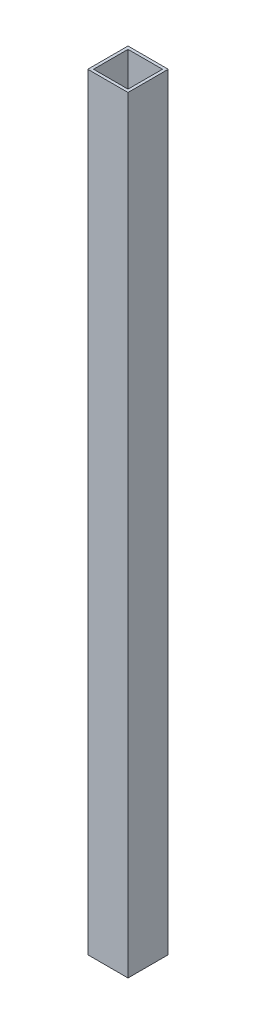
ISO-10303-21;
HEADER;
FILE_DESCRIPTION(('STEP AP214'),'2;1');
FILE_NAME('part.step','',(''),(''),'','','');
FILE_SCHEMA(('AUTOMOTIVE_DESIGN { 1 0 10303 214 1 1 1 1 }'));
ENDSEC;
DATA;
#1=APPLICATION_CONTEXT('core data for automotive mechanical design processes');
#2=APPLICATION_PROTOCOL_DEFINITION('international standard','automotive_design',2000,#1);
#3=PRODUCT_CONTEXT('',#1,'mechanical');
#4=PRODUCT('Part','Part','',(#3));
#5=PRODUCT_RELATED_PRODUCT_CATEGORY('part','',(#4));
#6=PRODUCT_DEFINITION_FORMATION('','',#4);
#7=PRODUCT_DEFINITION_CONTEXT('part definition',#1,'design');
#8=PRODUCT_DEFINITION('design','',#6,#7);
#9=PRODUCT_DEFINITION_SHAPE('','',#8);
#10=(LENGTH_UNIT() NAMED_UNIT(*) SI_UNIT(.MILLI.,.METRE.));
#11=(NAMED_UNIT(*) PLANE_ANGLE_UNIT() SI_UNIT($,.RADIAN.));
#12=(NAMED_UNIT(*) SI_UNIT($,.STERADIAN.) SOLID_ANGLE_UNIT());
#13=UNCERTAINTY_MEASURE_WITH_UNIT(LENGTH_MEASURE(1.E-05),#10,'distance_accuracy_value','');
#14=(GEOMETRIC_REPRESENTATION_CONTEXT(3) GLOBAL_UNCERTAINTY_ASSIGNED_CONTEXT((#13)) GLOBAL_UNIT_ASSIGNED_CONTEXT((#10,
#11,#12)) REPRESENTATION_CONTEXT('',''));
#15=CARTESIAN_POINT('',(0.,0.,0.));
#16=DIRECTION('',(0.,0.,1.));
#17=DIRECTION('',(1.,0.,0.));
#18=AXIS2_PLACEMENT_3D('',#15,#16,#17);
#19=CARTESIAN_POINT('',(401.427112483978,-847.1408,-209.294155168534));
#20=DIRECTION('',(0.,0.,1.));
#21=DIRECTION('',(1.,0.,0.));
#22=AXIS2_PLACEMENT_3D('',#19,#20,#21);
#23=PLANE('',#22);
#24=DIRECTION('',(1.,0.,0.));
#25=VECTOR('',#24,1.);
#26=CARTESIAN_POINT('',(401.427112483978,0.,-209.294155168534));
#27=LINE('',#26,#25);
#28=CARTESIAN_POINT('',(379.202112483979,0.,-209.294155168534));
#29=VERTEX_POINT('',#28);
#30=CARTESIAN_POINT('',(423.652112483979,0.,-209.294155168534));
#31=VERTEX_POINT('',#30);
#32=EDGE_CURVE('E168',#29,#31,#27,.T.);
#33=ORIENTED_EDGE('',*,*,#32,.F.);
#34=DIRECTION('',(0.,1.,0.));
#35=VECTOR('',#34,1.);
#36=CARTESIAN_POINT('',(379.202112483979,-847.1408,-209.294155168534));
#37=LINE('',#36,#35);
#38=CARTESIAN_POINT('',(379.202112483979,-847.1408,-209.294155168534));
#39=VERTEX_POINT('',#38);
#40=EDGE_CURVE('E9',#39,#29,#37,.T.);
#41=ORIENTED_EDGE('',*,*,#40,.F.);
#42=DIRECTION('',(1.,0.,0.));
#43=VECTOR('',#42,1.);
#44=CARTESIAN_POINT('',(401.427112483978,-847.1408,-209.294155168534));
#45=LINE('',#44,#43);
#46=CARTESIAN_POINT('',(423.652112483979,-847.1408,-209.294155168534));
#47=VERTEX_POINT('',#46);
#48=EDGE_CURVE('E123',#39,#47,#45,.T.);
#49=ORIENTED_EDGE('',*,*,#48,.T.);
#50=DIRECTION('',(0.,1.,0.));
#51=VECTOR('',#50,1.);
#52=CARTESIAN_POINT('',(423.652112483979,-847.1408,-209.294155168534));
#53=LINE('',#52,#51);
#54=EDGE_CURVE('E39',#47,#31,#53,.T.);
#55=ORIENTED_EDGE('',*,*,#54,.T.);
#56=EDGE_LOOP('',(#33,#41,#49,#55));
#57=FACE_BOUND('',#56,.T.);
#58=ADVANCED_FACE('F14',(#57),#23,.T.);
#59=CARTESIAN_POINT('',(379.202112483979,-847.1408,-231.519155168534));
#60=DIRECTION('',(1.,0.,0.));
#61=DIRECTION('',(0.,0.,-1.));
#62=AXIS2_PLACEMENT_3D('',#59,#60,#61);
#63=PLANE('',#62);
#64=DIRECTION('',(0.,0.,-1.));
#65=VECTOR('',#64,1.);
#66=CARTESIAN_POINT('',(379.202112483979,0.,-231.519155168534));
#67=LINE('',#66,#65);
#68=CARTESIAN_POINT('',(379.202112483979,0.,-253.744155168534));
#69=VERTEX_POINT('',#68);
#70=EDGE_CURVE('E129',#29,#69,#67,.T.);
#71=ORIENTED_EDGE('',*,*,#70,.T.);
#72=DIRECTION('',(0.,1.,0.));
#73=VECTOR('',#72,1.);
#74=CARTESIAN_POINT('',(379.202112483979,-847.1408,-253.744155168534));
#75=LINE('',#74,#73);
#76=CARTESIAN_POINT('',(379.202112483979,-847.1408,-253.744155168534));
#77=VERTEX_POINT('',#76);
#78=EDGE_CURVE('E25',#77,#69,#75,.T.);
#79=ORIENTED_EDGE('',*,*,#78,.F.);
#80=DIRECTION('',(0.,0.,-1.));
#81=VECTOR('',#80,1.);
#82=CARTESIAN_POINT('',(379.202112483979,-847.1408,-231.519155168534));
#83=LINE('',#82,#81);
#84=EDGE_CURVE('E118',#39,#77,#83,.T.);
#85=ORIENTED_EDGE('',*,*,#84,.F.);
#86=ORIENTED_EDGE('',*,*,#40,.T.);
#87=EDGE_LOOP('',(#71,#79,#85,#86));
#88=FACE_BOUND('',#87,.T.);
#89=ADVANCED_FACE('F127',(#88),#63,.F.);
#90=CARTESIAN_POINT('',(401.427112483978,-847.1408,-253.744155168534));
#91=DIRECTION('',(0.,0.,1.));
#92=DIRECTION('',(1.,0.,0.));
#93=AXIS2_PLACEMENT_3D('',#90,#91,#92);
#94=PLANE('',#93);
#95=DIRECTION('',(1.,0.,0.));
#96=VECTOR('',#95,1.);
#97=CARTESIAN_POINT('',(401.427112483978,0.,-253.744155168534));
#98=LINE('',#97,#96);
#99=CARTESIAN_POINT('',(423.652112483979,0.,-253.744155168534));
#100=VERTEX_POINT('',#99);
#101=EDGE_CURVE('E163',#69,#100,#98,.T.);
#102=ORIENTED_EDGE('',*,*,#101,.T.);
#103=DIRECTION('',(0.,1.,0.));
#104=VECTOR('',#103,1.);
#105=CARTESIAN_POINT('',(423.652112483979,-847.1408,-253.744155168534));
#106=LINE('',#105,#104);
#107=CARTESIAN_POINT('',(423.652112483979,-847.1408,-253.744155168534));
#108=VERTEX_POINT('',#107);
#109=EDGE_CURVE('E74',#108,#100,#106,.T.);
#110=ORIENTED_EDGE('',*,*,#109,.F.);
#111=DIRECTION('',(1.,0.,0.));
#112=VECTOR('',#111,1.);
#113=CARTESIAN_POINT('',(401.427112483978,-847.1408,-253.744155168534));
#114=LINE('',#113,#112);
#115=EDGE_CURVE('E109',#77,#108,#114,.T.);
#116=ORIENTED_EDGE('',*,*,#115,.F.);
#117=ORIENTED_EDGE('',*,*,#78,.T.);
#118=EDGE_LOOP('',(#102,#110,#116,#117));
#119=FACE_BOUND('',#118,.T.);
#120=ADVANCED_FACE('F111',(#119),#94,.F.);
#121=CARTESIAN_POINT('',(382.377112483979,-847.1408,-231.519155168534));
#122=DIRECTION('',(1.,0.,0.));
#123=DIRECTION('',(0.,0.,-1.));
#124=AXIS2_PLACEMENT_3D('',#121,#122,#123);
#125=PLANE('',#124);
#126=DIRECTION('',(0.,0.,-1.));
#127=VECTOR('',#126,1.);
#128=CARTESIAN_POINT('',(382.377112483979,0.,-231.519155168534));
#129=LINE('',#128,#127);
#130=CARTESIAN_POINT('',(382.377112483979,0.,-212.469155168534));
#131=VERTEX_POINT('',#130);
#132=CARTESIAN_POINT('',(382.377112483979,0.,-250.569155168534));
#133=VERTEX_POINT('',#132);
#134=EDGE_CURVE('E181',#131,#133,#129,.T.);
#135=ORIENTED_EDGE('',*,*,#134,.F.);
#136=DIRECTION('',(0.,1.,0.));
#137=VECTOR('',#136,1.);
#138=CARTESIAN_POINT('',(382.377112483979,-847.1408,-212.469155168534));
#139=LINE('',#138,#137);
#140=CARTESIAN_POINT('',(382.377112483979,-847.1408,-212.469155168534));
#141=VERTEX_POINT('',#140);
#142=EDGE_CURVE('E18',#141,#131,#139,.T.);
#143=ORIENTED_EDGE('',*,*,#142,.F.);
#144=DIRECTION('',(0.,0.,-1.));
#145=VECTOR('',#144,1.);
#146=CARTESIAN_POINT('',(382.377112483979,-847.1408,-231.519155168534));
#147=LINE('',#146,#145);
#148=CARTESIAN_POINT('',(382.377112483979,-847.1408,-250.569155168534));
#149=VERTEX_POINT('',#148);
#150=EDGE_CURVE('E162',#141,#149,#147,.T.);
#151=ORIENTED_EDGE('',*,*,#150,.T.);
#152=DIRECTION('',(0.,1.,0.));
#153=VECTOR('',#152,1.);
#154=CARTESIAN_POINT('',(382.377112483979,-847.1408,-250.569155168534));
#155=LINE('',#154,#153);
#156=EDGE_CURVE('E138',#149,#133,#155,.T.);
#157=ORIENTED_EDGE('',*,*,#156,.T.);
#158=EDGE_LOOP('',(#135,#143,#151,#157));
#159=FACE_BOUND('',#158,.T.);
#160=ADVANCED_FACE('F16',(#159),#125,.T.);
#161=CARTESIAN_POINT('',(401.427112483978,-847.1408,-212.469155168534));
#162=DIRECTION('',(0.,0.,1.));
#163=DIRECTION('',(1.,0.,0.));
#164=AXIS2_PLACEMENT_3D('',#161,#162,#163);
#165=PLANE('',#164);
#166=DIRECTION('',(1.,0.,0.));
#167=VECTOR('',#166,1.);
#168=CARTESIAN_POINT('',(401.427112483978,0.,-212.469155168534));
#169=LINE('',#168,#167);
#170=CARTESIAN_POINT('',(420.477112483978,0.,-212.469155168534));
#171=VERTEX_POINT('',#170);
#172=EDGE_CURVE('E178',#131,#171,#169,.T.);
#173=ORIENTED_EDGE('',*,*,#172,.T.);
#174=DIRECTION('',(0.,1.,0.));
#175=VECTOR('',#174,1.);
#176=CARTESIAN_POINT('',(420.477112483978,-847.1408,-212.469155168534));
#177=LINE('',#176,#175);
#178=CARTESIAN_POINT('',(420.477112483978,-847.1408,-212.469155168534));
#179=VERTEX_POINT('',#178);
#180=EDGE_CURVE('E143',#179,#171,#177,.T.);
#181=ORIENTED_EDGE('',*,*,#180,.F.);
#182=DIRECTION('',(1.,0.,0.));
#183=VECTOR('',#182,1.);
#184=CARTESIAN_POINT('',(401.427112483978,-847.1408,-212.469155168534));
#185=LINE('',#184,#183);
#186=EDGE_CURVE('E196',#141,#179,#185,.T.);
#187=ORIENTED_EDGE('',*,*,#186,.F.);
#188=ORIENTED_EDGE('',*,*,#142,.T.);
#189=EDGE_LOOP('',(#173,#181,#187,#188));
#190=FACE_BOUND('',#189,.T.);
#191=ADVANCED_FACE('F211',(#190),#165,.F.);
#192=CARTESIAN_POINT('',(420.477112483978,-847.1408,-231.519155168534));
#193=DIRECTION('',(1.,0.,0.));
#194=DIRECTION('',(0.,0.,-1.));
#195=AXIS2_PLACEMENT_3D('',#192,#193,#194);
#196=PLANE('',#195);
#197=DIRECTION('',(0.,0.,-1.));
#198=VECTOR('',#197,1.);
#199=CARTESIAN_POINT('',(420.477112483978,0.,-231.519155168534));
#200=LINE('',#199,#198);
#201=CARTESIAN_POINT('',(420.477112483978,0.,-250.569155168534));
#202=VERTEX_POINT('',#201);
#203=EDGE_CURVE('E175',#171,#202,#200,.T.);
#204=ORIENTED_EDGE('',*,*,#203,.T.);
#205=DIRECTION('',(0.,1.,0.));
#206=VECTOR('',#205,1.);
#207=CARTESIAN_POINT('',(420.477112483978,-847.1408,-250.569155168534));
#208=LINE('',#207,#206);
#209=CARTESIAN_POINT('',(420.477112483978,-847.1408,-250.569155168534));
#210=VERTEX_POINT('',#209);
#211=EDGE_CURVE('E141',#210,#202,#208,.T.);
#212=ORIENTED_EDGE('',*,*,#211,.F.);
#213=DIRECTION('',(0.,0.,-1.));
#214=VECTOR('',#213,1.);
#215=CARTESIAN_POINT('',(420.477112483978,-847.1408,-231.519155168534));
#216=LINE('',#215,#214);
#217=EDGE_CURVE('E193',#179,#210,#216,.T.);
#218=ORIENTED_EDGE('',*,*,#217,.F.);
#219=ORIENTED_EDGE('',*,*,#180,.T.);
#220=EDGE_LOOP('',(#204,#212,#218,#219));
#221=FACE_BOUND('',#220,.T.);
#222=ADVANCED_FACE('F212',(#221),#196,.F.);
#223=CARTESIAN_POINT('',(401.427112483978,-847.1408,-250.569155168534));
#224=DIRECTION('',(0.,0.,1.));
#225=DIRECTION('',(1.,0.,0.));
#226=AXIS2_PLACEMENT_3D('',#223,#224,#225);
#227=PLANE('',#226);
#228=DIRECTION('',(1.,0.,0.));
#229=VECTOR('',#228,1.);
#230=CARTESIAN_POINT('',(401.427112483978,0.,-250.569155168534));
#231=LINE('',#230,#229);
#232=EDGE_CURVE('E171',#133,#202,#231,.T.);
#233=ORIENTED_EDGE('',*,*,#232,.F.);
#234=ORIENTED_EDGE('',*,*,#156,.F.);
#235=DIRECTION('',(1.,0.,0.));
#236=VECTOR('',#235,1.);
#237=CARTESIAN_POINT('',(401.427112483978,-847.1408,-250.569155168534));
#238=LINE('',#237,#236);
#239=EDGE_CURVE('E189',#149,#210,#238,.T.);
#240=ORIENTED_EDGE('',*,*,#239,.T.);
#241=ORIENTED_EDGE('',*,*,#211,.T.);
#242=EDGE_LOOP('',(#233,#234,#240,#241));
#243=FACE_BOUND('',#242,.T.);
#244=ADVANCED_FACE('F207',(#243),#227,.T.);
#245=CARTESIAN_POINT('',(423.652112483979,-847.1408,-231.519155168534));
#246=DIRECTION('',(1.,0.,0.));
#247=DIRECTION('',(0.,0.,-1.));
#248=AXIS2_PLACEMENT_3D('',#245,#246,#247);
#249=PLANE('',#248);
#250=DIRECTION('',(0.,0.,-1.));
#251=VECTOR('',#250,1.);
#252=CARTESIAN_POINT('',(423.652112483979,0.,-231.519155168534));
#253=LINE('',#252,#251);
#254=EDGE_CURVE('E158',#31,#100,#253,.T.);
#255=ORIENTED_EDGE('',*,*,#254,.F.);
#256=ORIENTED_EDGE('',*,*,#54,.F.);
#257=DIRECTION('',(0.,0.,-1.));
#258=VECTOR('',#257,1.);
#259=CARTESIAN_POINT('',(423.652112483979,-847.1408,-231.519155168534));
#260=LINE('',#259,#258);
#261=EDGE_CURVE('E117',#47,#108,#260,.T.);
#262=ORIENTED_EDGE('',*,*,#261,.T.);
#263=ORIENTED_EDGE('',*,*,#109,.T.);
#264=EDGE_LOOP('',(#255,#256,#262,#263));
#265=FACE_BOUND('',#264,.T.);
#266=ADVANCED_FACE('F220',(#265),#249,.T.);
#267=CARTESIAN_POINT('',(401.427112483978,-847.1408,-231.519155168534));
#268=DIRECTION('',(0.,-1.,0.));
#269=DIRECTION('',(1.,0.,0.));
#270=AXIS2_PLACEMENT_3D('',#267,#268,#269);
#271=PLANE('',#270);
#272=ORIENTED_EDGE('',*,*,#150,.F.);
#273=ORIENTED_EDGE('',*,*,#186,.T.);
#274=ORIENTED_EDGE('',*,*,#217,.T.);
#275=ORIENTED_EDGE('',*,*,#239,.F.);
#276=EDGE_LOOP('',(#272,#273,#274,#275));
#277=FACE_BOUND('',#276,.T.);
#278=ORIENTED_EDGE('',*,*,#48,.F.);
#279=ORIENTED_EDGE('',*,*,#84,.T.);
#280=ORIENTED_EDGE('',*,*,#115,.T.);
#281=ORIENTED_EDGE('',*,*,#261,.F.);
#282=EDGE_LOOP('',(#278,#279,#280,#281));
#283=FACE_BOUND('',#282,.T.);
#284=ADVANCED_FACE('F122',(#277,#283),#271,.T.);
#285=CARTESIAN_POINT('',(401.427112483978,0.,-231.519155168534));
#286=DIRECTION('',(0.,-1.,0.));
#287=DIRECTION('',(1.,0.,0.));
#288=AXIS2_PLACEMENT_3D('',#285,#286,#287);
#289=PLANE('',#288);
#290=ORIENTED_EDGE('',*,*,#134,.T.);
#291=ORIENTED_EDGE('',*,*,#232,.T.);
#292=ORIENTED_EDGE('',*,*,#203,.F.);
#293=ORIENTED_EDGE('',*,*,#172,.F.);
#294=EDGE_LOOP('',(#290,#291,#292,#293));
#295=FACE_BOUND('',#294,.T.);
#296=ORIENTED_EDGE('',*,*,#32,.T.);
#297=ORIENTED_EDGE('',*,*,#254,.T.);
#298=ORIENTED_EDGE('',*,*,#101,.F.);
#299=ORIENTED_EDGE('',*,*,#70,.F.);
#300=EDGE_LOOP('',(#296,#297,#298,#299));
#301=FACE_BOUND('',#300,.T.);
#302=ADVANCED_FACE('F209',(#295,#301),#289,.F.);
#303=CLOSED_SHELL('',(#58,#89,#120,#160,#191,#222,#244,#266,#284,#302));
#304=MANIFOLD_SOLID_BREP('B1',#303);
#305=ADVANCED_BREP_SHAPE_REPRESENTATION('',(#18,#304),#14);
#306=SHAPE_DEFINITION_REPRESENTATION(#9,#305);
ENDSEC;
END-ISO-10303-21;
